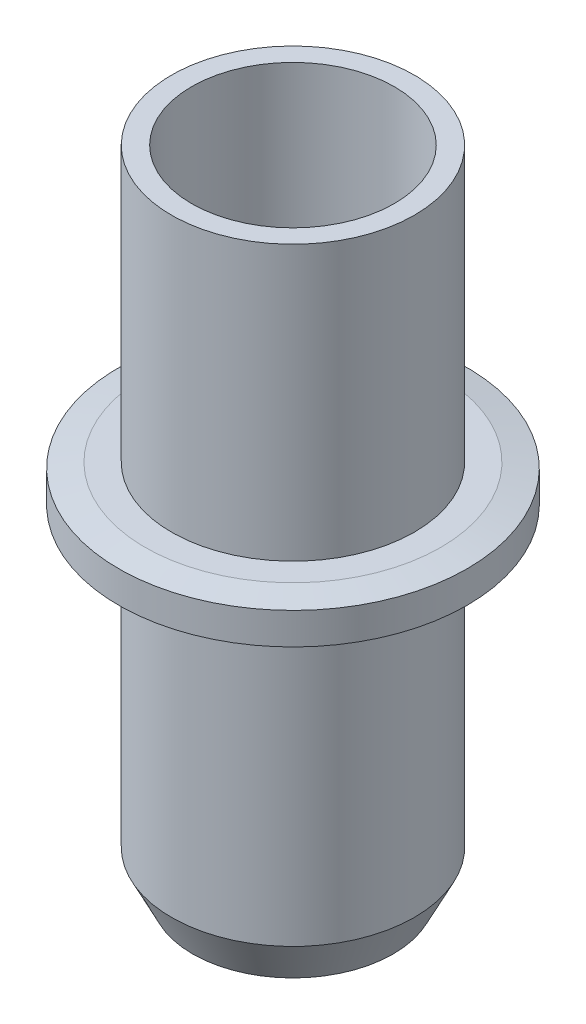
ISO-10303-21;
HEADER;
FILE_DESCRIPTION(('STEP AP214'),'2;1');
FILE_NAME('part.step','',(''),(''),'','','');
FILE_SCHEMA(('AUTOMOTIVE_DESIGN { 1 0 10303 214 1 1 1 1 }'));
ENDSEC;
DATA;
#1=APPLICATION_CONTEXT('core data for automotive mechanical design processes');
#2=APPLICATION_PROTOCOL_DEFINITION('international standard','automotive_design',2000,#1);
#3=PRODUCT_CONTEXT('',#1,'mechanical');
#4=PRODUCT('Part','Part','',(#3));
#5=PRODUCT_RELATED_PRODUCT_CATEGORY('part','',(#4));
#6=PRODUCT_DEFINITION_FORMATION('','',#4);
#7=PRODUCT_DEFINITION_CONTEXT('part definition',#1,'design');
#8=PRODUCT_DEFINITION('design','',#6,#7);
#9=PRODUCT_DEFINITION_SHAPE('','',#8);
#10=(LENGTH_UNIT() NAMED_UNIT(*) SI_UNIT(.MILLI.,.METRE.));
#11=(NAMED_UNIT(*) PLANE_ANGLE_UNIT() SI_UNIT($,.RADIAN.));
#12=(NAMED_UNIT(*) SI_UNIT($,.STERADIAN.) SOLID_ANGLE_UNIT());
#13=UNCERTAINTY_MEASURE_WITH_UNIT(LENGTH_MEASURE(1.E-05),#10,'distance_accuracy_value','');
#14=(GEOMETRIC_REPRESENTATION_CONTEXT(3) GLOBAL_UNCERTAINTY_ASSIGNED_CONTEXT((#13)) GLOBAL_UNIT_ASSIGNED_CONTEXT((#10,
#11,#12)) REPRESENTATION_CONTEXT('',''));
#15=CARTESIAN_POINT('',(0.,0.,0.));
#16=DIRECTION('',(0.,0.,1.));
#17=DIRECTION('',(1.,0.,0.));
#18=AXIS2_PLACEMENT_3D('',#15,#16,#17);
#19=CARTESIAN_POINT('',(3.2,6.5,0.));
#20=DIRECTION('',(0.,-1.,0.));
#21=DIRECTION('',(1.,0.,0.));
#22=AXIS2_PLACEMENT_3D('',#19,#20,#21);
#23=PLANE('',#22);
#24=CARTESIAN_POINT('',(0.,6.49999999999999,0.));
#25=DIRECTION('',(0.,-1.,0.));
#26=DIRECTION('',(1.,0.,0.));
#27=AXIS2_PLACEMENT_3D('',#24,#25,#26);
#28=CIRCLE('',#27,3.48368706811452);
#29=CARTESIAN_POINT('',(3.4836870681145,6.5,0.));
#30=VERTEX_POINT('',#29);
#31=EDGE_CURVE('E47',#30,#30,#28,.T.);
#32=ORIENTED_EDGE('',*,*,#31,.F.);
#33=EDGE_LOOP('',(#32));
#34=FACE_BOUND('',#33,.T.);
#35=CARTESIAN_POINT('',(0.,6.49999999999998,0.));
#36=DIRECTION('',(0.,-1.,0.));
#37=DIRECTION('',(1.,0.,0.));
#38=AXIS2_PLACEMENT_3D('',#35,#36,#37);
#39=CIRCLE('',#38,4.75000000000002);
#40=CARTESIAN_POINT('',(4.75,6.49999999999999,0.));
#41=VERTEX_POINT('',#40);
#42=EDGE_CURVE('E50',#41,#41,#39,.T.);
#43=ORIENTED_EDGE('',*,*,#42,.T.);
#44=EDGE_LOOP('',(#43));
#45=FACE_BOUND('',#44,.T.);
#46=ADVANCED_FACE('F31',(#34,#45),#23,.T.);
#47=CARTESIAN_POINT('',(0.,6.49999999999998,0.));
#48=DIRECTION('',(0.,1.,0.));
#49=DIRECTION('',(-1.,0.,0.));
#50=AXIS2_PLACEMENT_3D('',#47,#48,#49);
#51=CONICAL_SURFACE('',#50,4.75000000000002,0.463647609000808);
#52=CARTESIAN_POINT('',(0.,8.49999999999998,0.));
#53=DIRECTION('',(0.,-1.,0.));
#54=DIRECTION('',(1.,0.,0.));
#55=AXIS2_PLACEMENT_3D('',#52,#53,#54);
#56=CIRCLE('',#55,5.75000000000003);
#57=CARTESIAN_POINT('',(5.75,8.5,0.));
#58=VERTEX_POINT('',#57);
#59=EDGE_CURVE('E53',#58,#58,#56,.T.);
#60=ORIENTED_EDGE('',*,*,#59,.T.);
#61=EDGE_LOOP('',(#60));
#62=FACE_BOUND('',#61,.T.);
#63=ORIENTED_EDGE('',*,*,#42,.F.);
#64=EDGE_LOOP('',(#63));
#65=FACE_BOUND('',#64,.T.);
#66=ADVANCED_FACE('F85',(#62,#65),#51,.T.);
#67=CARTESIAN_POINT('',(5.02600346399491E-13,-143.950460455854,0.));
#68=DIRECTION('',(0.,-1.,0.));
#69=DIRECTION('',(1.,0.,0.));
#70=AXIS2_PLACEMENT_3D('',#67,#68,#69);
#71=CYLINDRICAL_SURFACE('',#70,5.75000000000005);
#72=CARTESIAN_POINT('',(0.,22.3,0.));
#73=DIRECTION('',(0.,-1.,0.));
#74=DIRECTION('',(1.,0.,0.));
#75=AXIS2_PLACEMENT_3D('',#72,#73,#74);
#76=CIRCLE('',#75,5.75000000000008);
#77=CARTESIAN_POINT('',(5.75,22.3,0.));
#78=VERTEX_POINT('',#77);
#79=EDGE_CURVE('E56',#78,#78,#76,.T.);
#80=ORIENTED_EDGE('',*,*,#79,.T.);
#81=EDGE_LOOP('',(#80));
#82=FACE_BOUND('',#81,.T.);
#83=ORIENTED_EDGE('',*,*,#59,.F.);
#84=EDGE_LOOP('',(#83));
#85=FACE_BOUND('',#84,.T.);
#86=ADVANCED_FACE('F90',(#82,#85),#71,.T.);
#87=CARTESIAN_POINT('',(5.75,22.3,0.));
#88=DIRECTION('',(0.,-1.,0.));
#89=DIRECTION('',(1.,0.,0.));
#90=AXIS2_PLACEMENT_3D('',#87,#88,#89);
#91=PLANE('',#90);
#92=CARTESIAN_POINT('',(0.,22.3,0.));
#93=DIRECTION('',(0.,-1.,0.));
#94=DIRECTION('',(1.,0.,0.));
#95=AXIS2_PLACEMENT_3D('',#92,#93,#94);
#96=CIRCLE('',#95,7.00000000000008);
#97=CARTESIAN_POINT('',(7.,22.3,0.));
#98=VERTEX_POINT('',#97);
#99=EDGE_CURVE('E59',#98,#98,#96,.T.);
#100=ORIENTED_EDGE('',*,*,#99,.T.);
#101=EDGE_LOOP('',(#100));
#102=FACE_BOUND('',#101,.T.);
#103=ORIENTED_EDGE('',*,*,#79,.F.);
#104=EDGE_LOOP('',(#103));
#105=FACE_BOUND('',#104,.T.);
#106=ADVANCED_FACE('F96',(#102,#105),#91,.T.);
#107=CARTESIAN_POINT('',(0.,22.3,0.));
#108=DIRECTION('',(0.,1.,0.));
#109=DIRECTION('',(-1.,0.,0.));
#110=AXIS2_PLACEMENT_3D('',#107,#108,#109);
#111=CONICAL_SURFACE('',#110,7.00000000000008,1.37340076694502);
#112=CARTESIAN_POINT('',(0.,22.55,0.));
#113=DIRECTION('',(0.,-1.,0.));
#114=DIRECTION('',(1.,0.,0.));
#115=AXIS2_PLACEMENT_3D('',#112,#113,#114);
#116=CIRCLE('',#115,8.25000000000008);
#117=CARTESIAN_POINT('',(8.25,22.55,0.));
#118=VERTEX_POINT('',#117);
#119=EDGE_CURVE('E62',#118,#118,#116,.T.);
#120=ORIENTED_EDGE('',*,*,#119,.T.);
#121=EDGE_LOOP('',(#120));
#122=FACE_BOUND('',#121,.T.);
#123=ORIENTED_EDGE('',*,*,#99,.F.);
#124=EDGE_LOOP('',(#123));
#125=FACE_BOUND('',#124,.T.);
#126=ADVANCED_FACE('F102',(#122,#125),#111,.T.);
#127=CARTESIAN_POINT('',(5.02600346399491E-13,-143.950460455854,0.));
#128=DIRECTION('',(0.,-1.,0.));
#129=DIRECTION('',(1.,0.,0.));
#130=AXIS2_PLACEMENT_3D('',#127,#128,#129);
#131=CYLINDRICAL_SURFACE('',#130,8.25000000000008);
#132=CARTESIAN_POINT('',(0.,24.05,0.));
#133=DIRECTION('',(0.,-1.,0.));
#134=DIRECTION('',(1.,0.,0.));
#135=AXIS2_PLACEMENT_3D('',#132,#133,#134);
#136=CIRCLE('',#135,8.25000000000008);
#137=CARTESIAN_POINT('',(8.25,24.05,0.));
#138=VERTEX_POINT('',#137);
#139=EDGE_CURVE('E65',#138,#138,#136,.T.);
#140=ORIENTED_EDGE('',*,*,#139,.T.);
#141=EDGE_LOOP('',(#140));
#142=FACE_BOUND('',#141,.T.);
#143=ORIENTED_EDGE('',*,*,#119,.F.);
#144=EDGE_LOOP('',(#143));
#145=FACE_BOUND('',#144,.T.);
#146=ADVANCED_FACE('F106',(#142,#145),#131,.T.);
#147=CARTESIAN_POINT('',(0.,24.05,0.));
#148=DIRECTION('',(0.,-1.,0.));
#149=DIRECTION('',(1.,0.,0.));
#150=AXIS2_PLACEMENT_3D('',#147,#148,#149);
#151=CONICAL_SURFACE('',#150,8.25000000000008,1.37340076694502);
#152=CARTESIAN_POINT('',(0.,24.3,0.));
#153=DIRECTION('',(0.,-1.,0.));
#154=DIRECTION('',(1.,0.,0.));
#155=AXIS2_PLACEMENT_3D('',#152,#153,#154);
#156=CIRCLE('',#155,7.00000000000009);
#157=CARTESIAN_POINT('',(7.,24.3,0.));
#158=VERTEX_POINT('',#157);
#159=EDGE_CURVE('E68',#158,#158,#156,.T.);
#160=ORIENTED_EDGE('',*,*,#159,.T.);
#161=EDGE_LOOP('',(#160));
#162=FACE_BOUND('',#161,.T.);
#163=ORIENTED_EDGE('',*,*,#139,.F.);
#164=EDGE_LOOP('',(#163));
#165=FACE_BOUND('',#164,.T.);
#166=ADVANCED_FACE('F110',(#162,#165),#151,.T.);
#167=CARTESIAN_POINT('',(7.,24.3,0.));
#168=DIRECTION('',(0.,1.,0.));
#169=DIRECTION('',(-1.,0.,0.));
#170=AXIS2_PLACEMENT_3D('',#167,#168,#169);
#171=PLANE('',#170);
#172=CARTESIAN_POINT('',(0.,24.3,0.));
#173=DIRECTION('',(0.,-1.,0.));
#174=DIRECTION('',(1.,0.,0.));
#175=AXIS2_PLACEMENT_3D('',#172,#173,#174);
#176=CIRCLE('',#175,5.75000000000009);
#177=CARTESIAN_POINT('',(5.75,24.3,0.));
#178=VERTEX_POINT('',#177);
#179=EDGE_CURVE('E71',#178,#178,#176,.T.);
#180=ORIENTED_EDGE('',*,*,#179,.T.);
#181=EDGE_LOOP('',(#180));
#182=FACE_BOUND('',#181,.T.);
#183=ORIENTED_EDGE('',*,*,#159,.F.);
#184=EDGE_LOOP('',(#183));
#185=FACE_BOUND('',#184,.T.);
#186=ADVANCED_FACE('F114',(#182,#185),#171,.T.);
#187=CARTESIAN_POINT('',(5.02600346399491E-13,-143.950460455854,0.));
#188=DIRECTION('',(0.,-1.,0.));
#189=DIRECTION('',(1.,0.,0.));
#190=AXIS2_PLACEMENT_3D('',#187,#188,#189);
#191=CYLINDRICAL_SURFACE('',#190,5.75000000000011);
#192=CARTESIAN_POINT('',(-1.30232253938849E-13,37.3,0.));
#193=DIRECTION('',(0.,-1.,0.));
#194=DIRECTION('',(1.,0.,0.));
#195=AXIS2_PLACEMENT_3D('',#192,#193,#194);
#196=CIRCLE('',#195,5.75000000000013);
#197=CARTESIAN_POINT('',(5.75,37.3,0.));
#198=VERTEX_POINT('',#197);
#199=EDGE_CURVE('E74',#198,#198,#196,.T.);
#200=ORIENTED_EDGE('',*,*,#199,.T.);
#201=EDGE_LOOP('',(#200));
#202=FACE_BOUND('',#201,.T.);
#203=ORIENTED_EDGE('',*,*,#179,.F.);
#204=EDGE_LOOP('',(#203));
#205=FACE_BOUND('',#204,.T.);
#206=ADVANCED_FACE('F118',(#202,#205),#191,.T.);
#207=CARTESIAN_POINT('',(5.75,37.3,0.));
#208=DIRECTION('',(0.,1.,0.));
#209=DIRECTION('',(-1.,0.,0.));
#210=AXIS2_PLACEMENT_3D('',#207,#208,#209);
#211=PLANE('',#210);
#212=CARTESIAN_POINT('',(-1.30232253938849E-13,37.3000000000001,0.));
#213=DIRECTION('',(0.,1.,0.));
#214=DIRECTION('',(-1.,0.,0.));
#215=AXIS2_PLACEMENT_3D('',#212,#213,#214);
#216=CIRCLE('',#215,4.80000000000009);
#217=CARTESIAN_POINT('',(-4.80000000000022,37.3000000000001,0.));
#218=VERTEX_POINT('',#217);
#219=EDGE_CURVE('E38',#218,#218,#216,.T.);
#220=ORIENTED_EDGE('',*,*,#219,.F.);
#221=EDGE_LOOP('',(#220));
#222=FACE_BOUND('',#221,.T.);
#223=ORIENTED_EDGE('',*,*,#199,.F.);
#224=EDGE_LOOP('',(#223));
#225=FACE_BOUND('',#224,.T.);
#226=ADVANCED_FACE('F122',(#222,#225),#211,.T.);
#227=CARTESIAN_POINT('',(0.,0.350000000000072,0.));
#228=DIRECTION('',(0.,1.,0.));
#229=DIRECTION('',(-1.,0.,0.));
#230=AXIS2_PLACEMENT_3D('',#227,#228,#229);
#231=CONICAL_SURFACE('',#230,2.4,0.174418770691646);
#232=ORIENTED_EDGE('',*,*,#31,.T.);
#233=EDGE_LOOP('',(#232));
#234=FACE_BOUND('',#233,.T.);
#235=CARTESIAN_POINT('',(0.,10.48,0.));
#236=DIRECTION('',(0.,-1.,0.));
#237=DIRECTION('',(1.,0.,0.));
#238=AXIS2_PLACEMENT_3D('',#235,#236,#237);
#239=CIRCLE('',#238,4.18500000000004);
#240=CARTESIAN_POINT('',(4.185,10.4800000000001,0.));
#241=VERTEX_POINT('',#240);
#242=EDGE_CURVE('E42',#241,#241,#239,.T.);
#243=ORIENTED_EDGE('',*,*,#242,.F.);
#244=EDGE_LOOP('',(#243));
#245=FACE_BOUND('',#244,.T.);
#246=ADVANCED_FACE('F33',(#234,#245),#231,.F.);
#247=CARTESIAN_POINT('',(4.185,10.48,0.));
#248=DIRECTION('',(0.,-1.,0.));
#249=DIRECTION('',(1.,0.,0.));
#250=AXIS2_PLACEMENT_3D('',#247,#248,#249);
#251=PLANE('',#250);
#252=CARTESIAN_POINT('',(0.,10.48,0.));
#253=DIRECTION('',(0.,-1.,0.));
#254=DIRECTION('',(1.,0.,0.));
#255=AXIS2_PLACEMENT_3D('',#252,#253,#254);
#256=CIRCLE('',#255,4.80000000000004);
#257=CARTESIAN_POINT('',(4.8,10.4800000000001,0.));
#258=VERTEX_POINT('',#257);
#259=EDGE_CURVE('E10',#258,#258,#256,.T.);
#260=ORIENTED_EDGE('',*,*,#259,.F.);
#261=EDGE_LOOP('',(#260));
#262=FACE_BOUND('',#261,.T.);
#263=ORIENTED_EDGE('',*,*,#242,.T.);
#264=EDGE_LOOP('',(#263));
#265=FACE_BOUND('',#264,.T.);
#266=ADVANCED_FACE('F126',(#262,#265),#251,.F.);
#267=CARTESIAN_POINT('',(3.49148133884313E-12,-1000.,0.));
#268=DIRECTION('',(0.,-1.,0.));
#269=DIRECTION('',(1.,0.,0.));
#270=AXIS2_PLACEMENT_3D('',#267,#268,#269);
#271=CYLINDRICAL_SURFACE('',#270,4.80000000000009);
#272=ORIENTED_EDGE('',*,*,#219,.T.);
#273=EDGE_LOOP('',(#272));
#274=FACE_BOUND('',#273,.T.);
#275=ORIENTED_EDGE('',*,*,#259,.T.);
#276=EDGE_LOOP('',(#275));
#277=FACE_BOUND('',#276,.T.);
#278=ADVANCED_FACE('F128',(#274,#277),#271,.F.);
#279=CLOSED_SHELL('',(#46,#66,#86,#106,#126,#146,#166,#186,#206,#226,#246,#266,#278));
#280=MANIFOLD_SOLID_BREP('B2',#279);
#281=ADVANCED_BREP_SHAPE_REPRESENTATION('',(#18,#280),#14);
#282=SHAPE_DEFINITION_REPRESENTATION(#9,#281);
ENDSEC;
END-ISO-10303-21;
